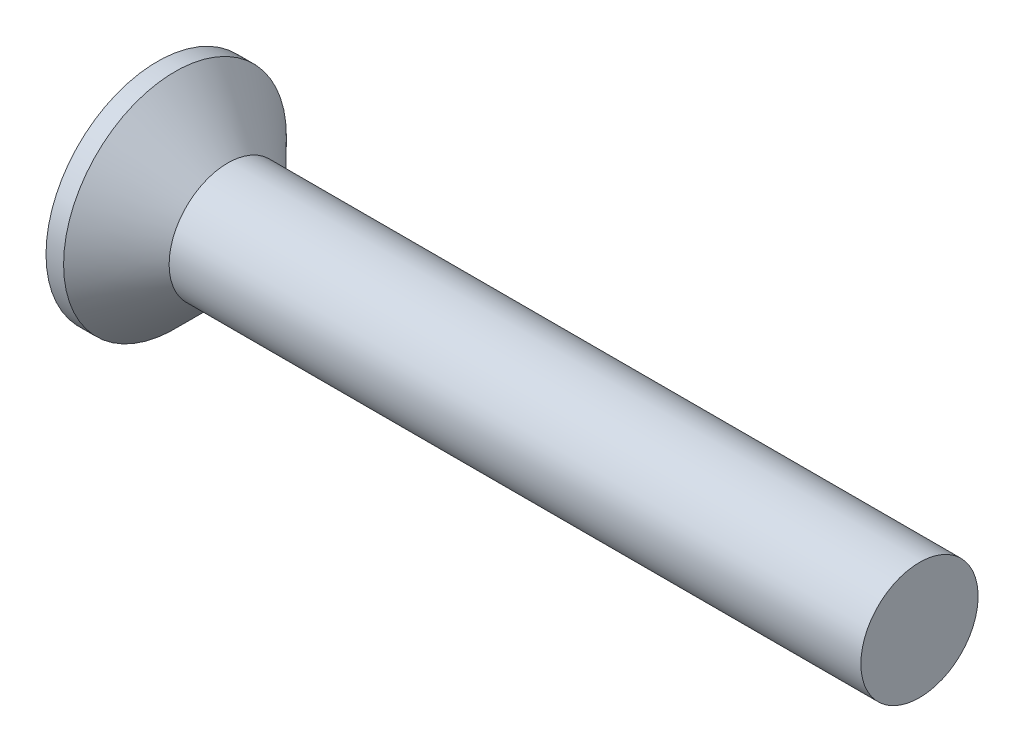
ISO-10303-21;
HEADER;
FILE_DESCRIPTION(('STEP AP214'),'2;1');
FILE_NAME('part.step','',(''),(''),'','','');
FILE_SCHEMA(('AUTOMOTIVE_DESIGN { 1 0 10303 214 1 1 1 1 }'));
ENDSEC;
DATA;
#1=APPLICATION_CONTEXT('core data for automotive mechanical design processes');
#2=APPLICATION_PROTOCOL_DEFINITION('international standard','automotive_design',2000,#1);
#3=PRODUCT_CONTEXT('',#1,'mechanical');
#4=PRODUCT('Part','Part','',(#3));
#5=PRODUCT_RELATED_PRODUCT_CATEGORY('part','',(#4));
#6=PRODUCT_DEFINITION_FORMATION('','',#4);
#7=PRODUCT_DEFINITION_CONTEXT('part definition',#1,'design');
#8=PRODUCT_DEFINITION('design','',#6,#7);
#9=PRODUCT_DEFINITION_SHAPE('','',#8);
#10=(LENGTH_UNIT() NAMED_UNIT(*) SI_UNIT(.MILLI.,.METRE.));
#11=(NAMED_UNIT(*) PLANE_ANGLE_UNIT() SI_UNIT($,.RADIAN.));
#12=(NAMED_UNIT(*) SI_UNIT($,.STERADIAN.) SOLID_ANGLE_UNIT());
#13=UNCERTAINTY_MEASURE_WITH_UNIT(LENGTH_MEASURE(1.E-05),#10,'distance_accuracy_value','');
#14=(GEOMETRIC_REPRESENTATION_CONTEXT(3) GLOBAL_UNCERTAINTY_ASSIGNED_CONTEXT((#13)) GLOBAL_UNIT_ASSIGNED_CONTEXT((#10,
#11,#12)) REPRESENTATION_CONTEXT('',''));
#15=CARTESIAN_POINT('',(0.,0.,0.));
#16=DIRECTION('',(0.,0.,1.));
#17=DIRECTION('',(1.,0.,0.));
#18=AXIS2_PLACEMENT_3D('',#15,#16,#17);
#19=CARTESIAN_POINT('',(0.,0.,0.));
#20=DIRECTION('',(-1.,0.,0.));
#21=DIRECTION('',(0.,0.,1.));
#22=AXIS2_PLACEMENT_3D('',#19,#20,#21);
#23=PLANE('',#22);
#24=CARTESIAN_POINT('',(0.,0.,0.));
#25=DIRECTION('',(-1.,0.,0.));
#26=DIRECTION('',(0.,0.,1.));
#27=AXIS2_PLACEMENT_3D('',#24,#25,#26);
#28=CIRCLE('',#27,1.9);
#29=CARTESIAN_POINT('',(0.,0.,1.9));
#30=VERTEX_POINT('',#29);
#31=EDGE_CURVE('E57',#30,#30,#28,.T.);
#32=ORIENTED_EDGE('',*,*,#31,.T.);
#33=EDGE_LOOP('',(#32));
#34=FACE_BOUND('',#33,.T.);
#35=DIRECTION('',(0.,1.,0.));
#36=VECTOR('',#35,1.);
#37=CARTESIAN_POINT('',(0.,-1.07,-0.264999999999999));
#38=LINE('',#37,#36);
#39=CARTESIAN_POINT('',(0.,-1.07,-0.264999999999999));
#40=VERTEX_POINT('',#39);
#41=CARTESIAN_POINT('',(0.,-0.264999999999999,-0.264999999999999));
#42=VERTEX_POINT('',#41);
#43=EDGE_CURVE('E119',#40,#42,#38,.T.);
#44=ORIENTED_EDGE('',*,*,#43,.T.);
#45=DIRECTION('',(0.,0.,-1.));
#46=VECTOR('',#45,1.);
#47=CARTESIAN_POINT('',(0.,-0.265000000000004,1.07));
#48=LINE('',#47,#46);
#49=CARTESIAN_POINT('',(0.,-0.264999999999996,-1.07));
#50=VERTEX_POINT('',#49);
#51=EDGE_CURVE('E98',#42,#50,#48,.T.);
#52=ORIENTED_EDGE('',*,*,#51,.T.);
#53=DIRECTION('',(0.,1.,0.));
#54=VECTOR('',#53,1.);
#55=CARTESIAN_POINT('',(0.,-0.264999999999996,-1.07));
#56=LINE('',#55,#54);
#57=CARTESIAN_POINT('',(0.,0.265000000000003,-1.07));
#58=VERTEX_POINT('',#57);
#59=EDGE_CURVE('E362',#50,#58,#56,.T.);
#60=ORIENTED_EDGE('',*,*,#59,.T.);
#61=DIRECTION('',(0.,0.,1.));
#62=VECTOR('',#61,1.);
#63=CARTESIAN_POINT('',(0.,0.265000000000003,-1.07));
#64=LINE('',#63,#62);
#65=CARTESIAN_POINT('',(0.,0.265,-0.264999999999999));
#66=VERTEX_POINT('',#65);
#67=EDGE_CURVE('E114',#58,#66,#64,.T.);
#68=ORIENTED_EDGE('',*,*,#67,.T.);
#69=CARTESIAN_POINT('',(0.,1.07,-0.264999999999999));
#70=VERTEX_POINT('',#69);
#71=EDGE_CURVE('E108',#66,#70,#38,.T.);
#72=ORIENTED_EDGE('',*,*,#71,.T.);
#73=DIRECTION('',(0.,0.,1.));
#74=VECTOR('',#73,1.);
#75=CARTESIAN_POINT('',(0.,1.07,-0.264999999999999));
#76=LINE('',#75,#74);
#77=CARTESIAN_POINT('',(0.,1.07,0.265));
#78=VERTEX_POINT('',#77);
#79=EDGE_CURVE('E111',#70,#78,#76,.T.);
#80=ORIENTED_EDGE('',*,*,#79,.T.);
#81=DIRECTION('',(0.,-1.,0.));
#82=VECTOR('',#81,1.);
#83=CARTESIAN_POINT('',(0.,1.07,0.265));
#84=LINE('',#83,#82);
#85=CARTESIAN_POINT('',(0.,0.264999999999998,0.265));
#86=VERTEX_POINT('',#85);
#87=EDGE_CURVE('E381',#78,#86,#84,.T.);
#88=ORIENTED_EDGE('',*,*,#87,.T.);
#89=CARTESIAN_POINT('',(0.,0.264999999999995,1.07));
#90=VERTEX_POINT('',#89);
#91=EDGE_CURVE('E353',#86,#90,#64,.T.);
#92=ORIENTED_EDGE('',*,*,#91,.T.);
#93=DIRECTION('',(0.,-1.,0.));
#94=VECTOR('',#93,1.);
#95=CARTESIAN_POINT('',(0.,0.264999999999995,1.07));
#96=LINE('',#95,#94);
#97=CARTESIAN_POINT('',(0.,-0.265000000000004,1.07));
#98=VERTEX_POINT('',#97);
#99=EDGE_CURVE('E338',#90,#98,#96,.T.);
#100=ORIENTED_EDGE('',*,*,#99,.T.);
#101=CARTESIAN_POINT('',(0.,-0.265000000000001,0.265));
#102=VERTEX_POINT('',#101);
#103=EDGE_CURVE('E351',#98,#102,#48,.T.);
#104=ORIENTED_EDGE('',*,*,#103,.T.);
#105=CARTESIAN_POINT('',(0.,-1.07,0.265));
#106=VERTEX_POINT('',#105);
#107=EDGE_CURVE('E126',#102,#106,#84,.T.);
#108=ORIENTED_EDGE('',*,*,#107,.T.);
#109=DIRECTION('',(0.,0.,-1.));
#110=VECTOR('',#109,1.);
#111=CARTESIAN_POINT('',(0.,-1.07,0.265));
#112=LINE('',#111,#110);
#113=EDGE_CURVE('E156',#106,#40,#112,.T.);
#114=ORIENTED_EDGE('',*,*,#113,.T.);
#115=EDGE_LOOP('',(#44,#52,#60,#68,#72,#80,#88,#92,#100,#104,#108,#114));
#116=FACE_BOUND('',#115,.T.);
#117=ADVANCED_FACE('F49',(#34,#116),#23,.T.);
#118=CARTESIAN_POINT('',(1.75765333333333,0.,0.113773333333333));
#119=DIRECTION('',(-0.0857222578731988,0.,-0.996319072639443));
#120=DIRECTION('',(-0.996319072639444,0.,0.0857222578731988));
#121=AXIS2_PLACEMENT_3D('',#118,#119,#120);
#122=PLANE('',#121);
#123=ORIENTED_EDGE('',*,*,#107,.F.);
#124=DIRECTION('',(0.992678495991953,0.0854090264408663,-0.085409026440866));
#125=VECTOR('',#124,1.);
#126=CARTESIAN_POINT('',(1.76729945793969,-0.112943390794151,0.112943390794151));
#127=LINE('',#126,#125);
#128=CARTESIAN_POINT('',(1.54,-0.132500000000001,0.1325));
#129=VERTEX_POINT('',#128);
#130=EDGE_CURVE('E150',#102,#129,#127,.T.);
#131=ORIENTED_EDGE('',*,*,#130,.T.);
#132=DIRECTION('',(0.851874354386278,0.518592342361776,-0.073294384387131));
#133=VECTOR('',#132,1.);
#134=CARTESIAN_POINT('',(0.,-1.07,0.265));
#135=LINE('',#134,#133);
#136=EDGE_CURVE('E120',#106,#129,#135,.T.);
#137=ORIENTED_EDGE('',*,*,#136,.F.);
#138=EDGE_LOOP('',(#123,#131,#137));
#139=FACE_BOUND('',#138,.T.);
#140=ADVANCED_FACE('F182',(#139),#122,.T.);
#141=DIRECTION('',(0.851874354386278,-0.518592342361776,-0.0732943843871309));
#142=VECTOR('',#141,1.);
#143=CARTESIAN_POINT('',(0.,1.07,0.265));
#144=LINE('',#143,#142);
#145=CARTESIAN_POINT('',(1.54,0.1325,0.1325));
#146=VERTEX_POINT('',#145);
#147=EDGE_CURVE('E64',#78,#146,#144,.T.);
#148=ORIENTED_EDGE('',*,*,#147,.T.);
#149=DIRECTION('',(-0.992678495991953,0.0854090264408653,0.085409026440866));
#150=VECTOR('',#149,1.);
#151=CARTESIAN_POINT('',(1.76729945793969,0.11294339079415,0.112943390794151));
#152=LINE('',#151,#150);
#153=EDGE_CURVE('E375',#146,#86,#152,.T.);
#154=ORIENTED_EDGE('',*,*,#153,.T.);
#155=ORIENTED_EDGE('',*,*,#87,.F.);
#156=EDGE_LOOP('',(#148,#154,#155));
#157=FACE_BOUND('',#156,.T.);
#158=ADVANCED_FACE('F187',(#157),#122,.T.);
#159=CARTESIAN_POINT('',(1.75765333333333,0.,-0.113773333333333));
#160=DIRECTION('',(-0.0857222578731983,0.,0.996319072639443));
#161=DIRECTION('',(0.996319072639444,0.,0.0857222578731983));
#162=AXIS2_PLACEMENT_3D('',#159,#160,#161);
#163=PLANE('',#162);
#164=DIRECTION('',(0.851874354386278,0.518592342361776,0.0732943843871306));
#165=VECTOR('',#164,1.);
#166=CARTESIAN_POINT('',(0.,-1.07,-0.264999999999999));
#167=LINE('',#166,#165);
#168=CARTESIAN_POINT('',(1.54,-0.1325,-0.132500000000001));
#169=VERTEX_POINT('',#168);
#170=EDGE_CURVE('E73',#40,#169,#167,.T.);
#171=ORIENTED_EDGE('',*,*,#170,.T.);
#172=DIRECTION('',(-0.992678495991953,-0.0854090264408657,-0.0854090264408656));
#173=VECTOR('',#172,1.);
#174=CARTESIAN_POINT('',(1.76729945793969,-0.11294339079415,-0.11294339079415));
#175=LINE('',#174,#173);
#176=EDGE_CURVE('E11',#169,#42,#175,.T.);
#177=ORIENTED_EDGE('',*,*,#176,.T.);
#178=ORIENTED_EDGE('',*,*,#43,.F.);
#179=EDGE_LOOP('',(#171,#177,#178));
#180=FACE_BOUND('',#179,.T.);
#181=ADVANCED_FACE('F179',(#180),#163,.T.);
#182=ORIENTED_EDGE('',*,*,#71,.F.);
#183=DIRECTION('',(0.992678495991953,-0.0854090264408659,0.0854090264408656));
#184=VECTOR('',#183,1.);
#185=CARTESIAN_POINT('',(1.76729945793969,0.112943390794151,-0.11294339079415));
#186=LINE('',#185,#184);
#187=CARTESIAN_POINT('',(1.54,0.1325,-0.1325));
#188=VERTEX_POINT('',#187);
#189=EDGE_CURVE('E129',#66,#188,#186,.T.);
#190=ORIENTED_EDGE('',*,*,#189,.T.);
#191=DIRECTION('',(0.851874354386278,-0.518592342361776,0.0732943843871306));
#192=VECTOR('',#191,1.);
#193=CARTESIAN_POINT('',(0.,1.07,-0.264999999999999));
#194=LINE('',#193,#192);
#195=EDGE_CURVE('E124',#70,#188,#194,.T.);
#196=ORIENTED_EDGE('',*,*,#195,.F.);
#197=EDGE_LOOP('',(#182,#190,#196));
#198=FACE_BOUND('',#197,.T.);
#199=ADVANCED_FACE('F128',(#198),#163,.T.);
#200=CARTESIAN_POINT('',(-6.34999999999999,0.,0.));
#201=DIRECTION('',(-1.,0.,0.));
#202=DIRECTION('',(0.,0.,1.));
#203=AXIS2_PLACEMENT_3D('',#200,#201,#202);
#204=CYLINDRICAL_SURFACE('',#203,1.9);
#205=CARTESIAN_POINT('',(0.300000000000004,0.,0.));
#206=DIRECTION('',(-1.,0.,0.));
#207=DIRECTION('',(0.,0.,1.));
#208=AXIS2_PLACEMENT_3D('',#205,#206,#207);
#209=CIRCLE('',#208,1.9);
#210=CARTESIAN_POINT('',(0.300000000000004,0.,1.9));
#211=VERTEX_POINT('',#210);
#212=EDGE_CURVE('E160',#211,#211,#209,.T.);
#213=ORIENTED_EDGE('',*,*,#212,.T.);
#214=EDGE_LOOP('',(#213));
#215=FACE_BOUND('',#214,.T.);
#216=ORIENTED_EDGE('',*,*,#31,.F.);
#217=EDGE_LOOP('',(#216));
#218=FACE_BOUND('',#217,.T.);
#219=ADVANCED_FACE('F168',(#215,#218),#204,.T.);
#220=CARTESIAN_POINT('',(0.300000000000004,0.,0.));
#221=DIRECTION('',(-1.,0.,0.));
#222=DIRECTION('',(0.,0.,1.));
#223=AXIS2_PLACEMENT_3D('',#220,#221,#222);
#224=CONICAL_SURFACE('',#223,1.9,0.785398163397451);
#225=CARTESIAN_POINT('',(1.2,0.,0.));
#226=DIRECTION('',(-1.,0.,0.));
#227=DIRECTION('',(0.,0.,1.));
#228=AXIS2_PLACEMENT_3D('',#225,#226,#227);
#229=CIRCLE('',#228,1.);
#230=CARTESIAN_POINT('',(1.2,0.,1.));
#231=VERTEX_POINT('',#230);
#232=EDGE_CURVE('E155',#231,#231,#229,.T.);
#233=ORIENTED_EDGE('',*,*,#232,.T.);
#234=EDGE_LOOP('',(#233));
#235=FACE_BOUND('',#234,.T.);
#236=ORIENTED_EDGE('',*,*,#212,.F.);
#237=EDGE_LOOP('',(#236));
#238=FACE_BOUND('',#237,.T.);
#239=ADVANCED_FACE('F170',(#235,#238),#224,.T.);
#240=CARTESIAN_POINT('',(-6.34999999999999,0.,0.));
#241=DIRECTION('',(-1.,0.,0.));
#242=DIRECTION('',(0.,0.,1.));
#243=AXIS2_PLACEMENT_3D('',#240,#241,#242);
#244=CYLINDRICAL_SURFACE('',#243,1.);
#245=CARTESIAN_POINT('',(13.,0.,0.));
#246=DIRECTION('',(-1.,0.,0.));
#247=DIRECTION('',(0.,0.,1.));
#248=AXIS2_PLACEMENT_3D('',#245,#246,#247);
#249=CIRCLE('',#248,1.);
#250=CARTESIAN_POINT('',(13.,0.,1.));
#251=VERTEX_POINT('',#250);
#252=EDGE_CURVE('E151',#251,#251,#249,.T.);
#253=ORIENTED_EDGE('',*,*,#252,.T.);
#254=EDGE_LOOP('',(#253));
#255=FACE_BOUND('',#254,.T.);
#256=ORIENTED_EDGE('',*,*,#232,.F.);
#257=EDGE_LOOP('',(#256));
#258=FACE_BOUND('',#257,.T.);
#259=ADVANCED_FACE('F175',(#255,#258),#244,.T.);
#260=CARTESIAN_POINT('',(13.,1.,0.));
#261=DIRECTION('',(1.,0.,0.));
#262=DIRECTION('',(0.,0.,-1.));
#263=AXIS2_PLACEMENT_3D('',#260,#261,#262);
#264=PLANE('',#263);
#265=ORIENTED_EDGE('',*,*,#252,.F.);
#266=EDGE_LOOP('',(#265));
#267=FACE_BOUND('',#266,.T.);
#268=ADVANCED_FACE('F207',(#267),#264,.T.);
#269=CARTESIAN_POINT('',(1.54,0.1325,-0.1325));
#270=DIRECTION('',(1.,0.,0.));
#271=DIRECTION('',(0.,0.,-1.));
#272=AXIS2_PLACEMENT_3D('',#269,#270,#271);
#273=PLANE('',#272);
#274=DIRECTION('',(0.,1.,0.));
#275=VECTOR('',#274,1.);
#276=CARTESIAN_POINT('',(1.54,-0.1325,-0.1325));
#277=LINE('',#276,#275);
#278=EDGE_CURVE('E144',#169,#188,#277,.T.);
#279=ORIENTED_EDGE('',*,*,#278,.F.);
#280=DIRECTION('',(0.,0.,-1.));
#281=VECTOR('',#280,1.);
#282=CARTESIAN_POINT('',(1.54,-0.1325,0.1325));
#283=LINE('',#282,#281);
#284=EDGE_CURVE('E132',#129,#169,#283,.T.);
#285=ORIENTED_EDGE('',*,*,#284,.F.);
#286=DIRECTION('',(0.,-1.,0.));
#287=VECTOR('',#286,1.);
#288=CARTESIAN_POINT('',(1.54,0.1325,0.1325));
#289=LINE('',#288,#287);
#290=EDGE_CURVE('E137',#146,#129,#289,.T.);
#291=ORIENTED_EDGE('',*,*,#290,.F.);
#292=DIRECTION('',(0.,0.,1.));
#293=VECTOR('',#292,1.);
#294=CARTESIAN_POINT('',(1.54,0.1325,-0.1325));
#295=LINE('',#294,#293);
#296=EDGE_CURVE('E141',#188,#146,#295,.T.);
#297=ORIENTED_EDGE('',*,*,#296,.F.);
#298=EDGE_LOOP('',(#279,#285,#291,#297));
#299=FACE_BOUND('',#298,.T.);
#300=ADVANCED_FACE('F204',(#299),#273,.F.);
#301=CARTESIAN_POINT('',(1.54,-0.1325,-0.1325));
#302=DIRECTION('',(-0.519990936244092,0.854171777936963,0.));
#303=DIRECTION('',(-0.854171777936963,-0.519990936244092,0.));
#304=AXIS2_PLACEMENT_3D('',#301,#302,#303);
#305=PLANE('',#304);
#306=ORIENTED_EDGE('',*,*,#170,.F.);
#307=ORIENTED_EDGE('',*,*,#113,.F.);
#308=ORIENTED_EDGE('',*,*,#136,.T.);
#309=ORIENTED_EDGE('',*,*,#284,.T.);
#310=EDGE_LOOP('',(#306,#307,#308,#309));
#311=FACE_BOUND('',#310,.T.);
#312=ADVANCED_FACE('F196',(#311),#305,.T.);
#313=CARTESIAN_POINT('',(0.,1.07,0.265));
#314=DIRECTION('',(-0.519990936244092,-0.854171777936963,0.));
#315=DIRECTION('',(0.854171777936963,-0.519990936244092,0.));
#316=AXIS2_PLACEMENT_3D('',#313,#314,#315);
#317=PLANE('',#316);
#318=ORIENTED_EDGE('',*,*,#147,.F.);
#319=ORIENTED_EDGE('',*,*,#79,.F.);
#320=ORIENTED_EDGE('',*,*,#195,.T.);
#321=ORIENTED_EDGE('',*,*,#296,.T.);
#322=EDGE_LOOP('',(#318,#319,#320,#321));
#323=FACE_BOUND('',#322,.T.);
#324=ADVANCED_FACE('F123',(#323),#317,.T.);
#325=CARTESIAN_POINT('',(1.75765333333333,-0.113773333333333,0.));
#326=DIRECTION('',(-0.0857222578731988,0.996319072639443,0.));
#327=DIRECTION('',(-0.996319072639444,-0.0857222578731988,0.));
#328=AXIS2_PLACEMENT_3D('',#325,#326,#327);
#329=PLANE('',#328);
#330=DIRECTION('',(0.851874354386278,0.0732943843871292,0.518592342361776));
#331=VECTOR('',#330,1.);
#332=CARTESIAN_POINT('',(0.,-0.264999999999996,-1.07));
#333=LINE('',#332,#331);
#334=EDGE_CURVE('E365',#50,#169,#333,.T.);
#335=ORIENTED_EDGE('',*,*,#334,.F.);
#336=ORIENTED_EDGE('',*,*,#51,.F.);
#337=ORIENTED_EDGE('',*,*,#176,.F.);
#338=EDGE_LOOP('',(#335,#336,#337));
#339=FACE_BOUND('',#338,.T.);
#340=ADVANCED_FACE('F203',(#339),#329,.T.);
#341=CARTESIAN_POINT('',(1.75765333333333,0.113773333333333,0.));
#342=DIRECTION('',(-0.0857222578731983,-0.996319072639443,0.));
#343=DIRECTION('',(0.996319072639444,-0.0857222578731983,0.));
#344=AXIS2_PLACEMENT_3D('',#341,#342,#343);
#345=PLANE('',#344);
#346=ORIENTED_EDGE('',*,*,#67,.F.);
#347=DIRECTION('',(0.851874354386278,-0.0732943843871324,0.518592342361776));
#348=VECTOR('',#347,1.);
#349=CARTESIAN_POINT('',(0.,0.265000000000003,-1.07));
#350=LINE('',#349,#348);
#351=EDGE_CURVE('E89',#58,#188,#350,.T.);
#352=ORIENTED_EDGE('',*,*,#351,.T.);
#353=ORIENTED_EDGE('',*,*,#189,.F.);
#354=EDGE_LOOP('',(#346,#352,#353));
#355=FACE_BOUND('',#354,.T.);
#356=ADVANCED_FACE('F283',(#355),#345,.T.);
#357=CARTESIAN_POINT('',(1.54,0.1325,-0.1325));
#358=DIRECTION('',(-0.519990936244092,0.,0.854171777936963));
#359=DIRECTION('',(-0.854171777936963,0.,-0.519990936244092));
#360=AXIS2_PLACEMENT_3D('',#357,#358,#359);
#361=PLANE('',#360);
#362=ORIENTED_EDGE('',*,*,#351,.F.);
#363=ORIENTED_EDGE('',*,*,#59,.F.);
#364=ORIENTED_EDGE('',*,*,#334,.T.);
#365=ORIENTED_EDGE('',*,*,#278,.T.);
#366=EDGE_LOOP('',(#362,#363,#364,#365));
#367=FACE_BOUND('',#366,.T.);
#368=ADVANCED_FACE('F293',(#367),#361,.T.);
#369=ORIENTED_EDGE('',*,*,#103,.F.);
#370=DIRECTION('',(0.851874354386278,0.0732943843871327,-0.518592342361776));
#371=VECTOR('',#370,1.);
#372=CARTESIAN_POINT('',(0.,-0.265000000000004,1.07));
#373=LINE('',#372,#371);
#374=EDGE_CURVE('E335',#98,#129,#373,.T.);
#375=ORIENTED_EDGE('',*,*,#374,.T.);
#376=ORIENTED_EDGE('',*,*,#130,.F.);
#377=EDGE_LOOP('',(#369,#375,#376));
#378=FACE_BOUND('',#377,.T.);
#379=ADVANCED_FACE('F285',(#378),#329,.T.);
#380=DIRECTION('',(0.851874354386278,-0.0732943843871288,-0.518592342361776));
#381=VECTOR('',#380,1.);
#382=CARTESIAN_POINT('',(0.,0.264999999999995,1.07));
#383=LINE('',#382,#381);
#384=EDGE_CURVE('E347',#90,#146,#383,.T.);
#385=ORIENTED_EDGE('',*,*,#384,.F.);
#386=ORIENTED_EDGE('',*,*,#91,.F.);
#387=ORIENTED_EDGE('',*,*,#153,.F.);
#388=EDGE_LOOP('',(#385,#386,#387));
#389=FACE_BOUND('',#388,.T.);
#390=ADVANCED_FACE('F295',(#389),#345,.T.);
#391=CARTESIAN_POINT('',(0.,-0.265000000000004,1.07));
#392=DIRECTION('',(-0.519990936244092,0.,-0.854171777936963));
#393=DIRECTION('',(0.854171777936963,0.,-0.519990936244092));
#394=AXIS2_PLACEMENT_3D('',#391,#392,#393);
#395=PLANE('',#394);
#396=ORIENTED_EDGE('',*,*,#374,.F.);
#397=ORIENTED_EDGE('',*,*,#99,.F.);
#398=ORIENTED_EDGE('',*,*,#384,.T.);
#399=ORIENTED_EDGE('',*,*,#290,.T.);
#400=EDGE_LOOP('',(#396,#397,#398,#399));
#401=FACE_BOUND('',#400,.T.);
#402=ADVANCED_FACE('F320',(#401),#395,.T.);
#403=CLOSED_SHELL('',(#117,#140,#158,#181,#199,#219,#239,#259,#268,#300,#312,#324,#340,#356,
#368,#379,#390,#402));
#404=MANIFOLD_SOLID_BREP('B2',#403);
#405=ADVANCED_BREP_SHAPE_REPRESENTATION('',(#18,#404),#14);
#406=SHAPE_DEFINITION_REPRESENTATION(#9,#405);
ENDSEC;
END-ISO-10303-21;
